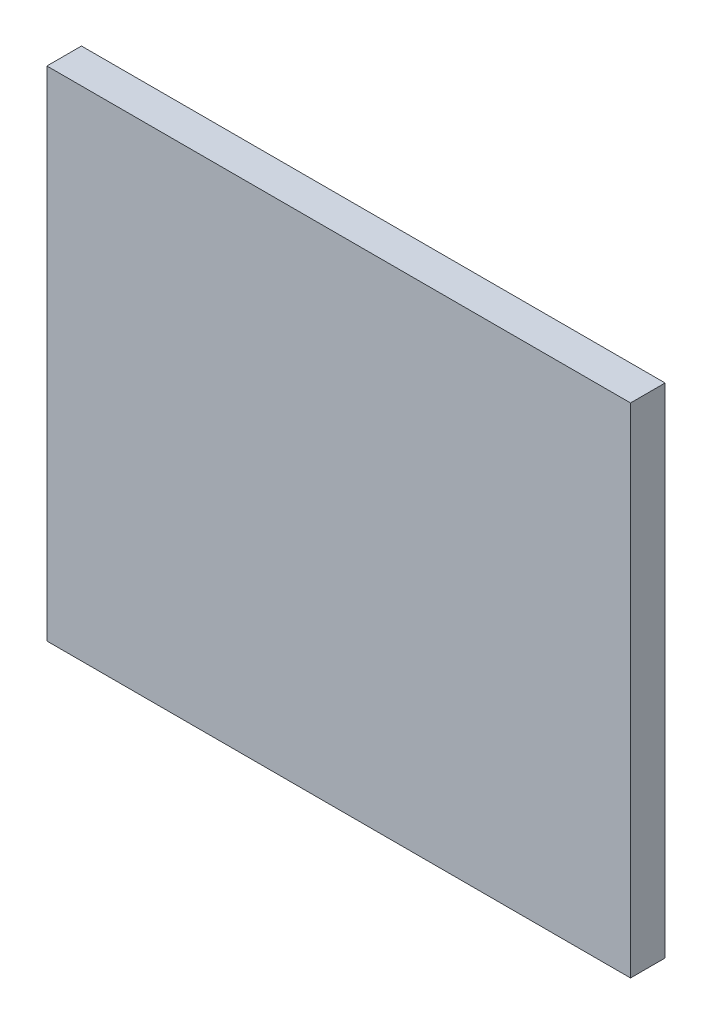
ISO-10303-21;
HEADER;
FILE_DESCRIPTION(('STEP AP214'),'2;1');
FILE_NAME('part.step','',(''),(''),'','','');
FILE_SCHEMA(('AUTOMOTIVE_DESIGN { 1 0 10303 214 1 1 1 1 }'));
ENDSEC;
DATA;
#1=APPLICATION_CONTEXT('core data for automotive mechanical design processes');
#2=APPLICATION_PROTOCOL_DEFINITION('international standard','automotive_design',2000,#1);
#3=PRODUCT_CONTEXT('',#1,'mechanical');
#4=PRODUCT('Part','Part','',(#3));
#5=PRODUCT_RELATED_PRODUCT_CATEGORY('part','',(#4));
#6=PRODUCT_DEFINITION_FORMATION('','',#4);
#7=PRODUCT_DEFINITION_CONTEXT('part definition',#1,'design');
#8=PRODUCT_DEFINITION('design','',#6,#7);
#9=PRODUCT_DEFINITION_SHAPE('','',#8);
#10=(LENGTH_UNIT() NAMED_UNIT(*) SI_UNIT(.MILLI.,.METRE.));
#11=(NAMED_UNIT(*) PLANE_ANGLE_UNIT() SI_UNIT($,.RADIAN.));
#12=(NAMED_UNIT(*) SI_UNIT($,.STERADIAN.) SOLID_ANGLE_UNIT());
#13=UNCERTAINTY_MEASURE_WITH_UNIT(LENGTH_MEASURE(1.E-05),#10,'distance_accuracy_value','');
#14=(GEOMETRIC_REPRESENTATION_CONTEXT(3) GLOBAL_UNCERTAINTY_ASSIGNED_CONTEXT((#13)) GLOBAL_UNIT_ASSIGNED_CONTEXT((#10,
#11,#12)) REPRESENTATION_CONTEXT('',''));
#15=CARTESIAN_POINT('',(0.,0.,0.));
#16=DIRECTION('',(0.,0.,1.));
#17=DIRECTION('',(1.,0.,0.));
#18=AXIS2_PLACEMENT_3D('',#15,#16,#17);
#19=CARTESIAN_POINT('',(0.,-20.,58.));
#20=DIRECTION('',(0.,-1.,0.));
#21=DIRECTION('',(1.,0.,0.));
#22=AXIS2_PLACEMENT_3D('',#19,#20,#21);
#23=PLANE('',#22);
#24=DIRECTION('',(-1.,0.,0.));
#25=VECTOR('',#24,1.);
#26=CARTESIAN_POINT('',(0.,-20.,50.));
#27=LINE('',#26,#25);
#28=CARTESIAN_POINT('',(67.5,-20.,50.));
#29=VERTEX_POINT('',#28);
#30=CARTESIAN_POINT('',(-67.5,-20.0000000000001,50.));
#31=VERTEX_POINT('',#30);
#32=EDGE_CURVE('E103',#29,#31,#27,.T.);
#33=ORIENTED_EDGE('',*,*,#32,.F.);
#34=DIRECTION('',(0.,0.,-1.));
#35=VECTOR('',#34,1.);
#36=CARTESIAN_POINT('',(67.5,-20.,58.));
#37=LINE('',#36,#35);
#38=CARTESIAN_POINT('',(67.5,-20.,58.));
#39=VERTEX_POINT('',#38);
#40=EDGE_CURVE('E11',#39,#29,#37,.T.);
#41=ORIENTED_EDGE('',*,*,#40,.F.);
#42=DIRECTION('',(-1.,0.,0.));
#43=VECTOR('',#42,1.);
#44=CARTESIAN_POINT('',(0.,-20.,58.));
#45=LINE('',#44,#43);
#46=CARTESIAN_POINT('',(-67.5,-20.0000000000001,58.));
#47=VERTEX_POINT('',#46);
#48=EDGE_CURVE('E97',#39,#47,#45,.T.);
#49=ORIENTED_EDGE('',*,*,#48,.T.);
#50=DIRECTION('',(0.,0.,-1.));
#51=VECTOR('',#50,1.);
#52=CARTESIAN_POINT('',(-67.5,-20.0000000000001,58.));
#53=LINE('',#52,#51);
#54=EDGE_CURVE('E42',#47,#31,#53,.T.);
#55=ORIENTED_EDGE('',*,*,#54,.T.);
#56=EDGE_LOOP('',(#33,#41,#49,#55));
#57=FACE_BOUND('',#56,.T.);
#58=ADVANCED_FACE('F39',(#57),#23,.T.);
#59=CARTESIAN_POINT('',(67.5,0.,58.));
#60=DIRECTION('',(1.,0.,0.));
#61=DIRECTION('',(0.,1.,0.));
#62=AXIS2_PLACEMENT_3D('',#59,#60,#61);
#63=PLANE('',#62);
#64=DIRECTION('',(0.,-1.,0.));
#65=VECTOR('',#64,1.);
#66=CARTESIAN_POINT('',(67.5,0.,50.));
#67=LINE('',#66,#65);
#68=CARTESIAN_POINT('',(67.5,95.1987948208455,50.));
#69=VERTEX_POINT('',#68);
#70=EDGE_CURVE('E99',#69,#29,#67,.T.);
#71=ORIENTED_EDGE('',*,*,#70,.F.);
#72=DIRECTION('',(0.,0.,-1.));
#73=VECTOR('',#72,1.);
#74=CARTESIAN_POINT('',(67.5,95.1987948208455,58.));
#75=LINE('',#74,#73);
#76=CARTESIAN_POINT('',(67.5,95.1987948208455,58.));
#77=VERTEX_POINT('',#76);
#78=EDGE_CURVE('E48',#77,#69,#75,.T.);
#79=ORIENTED_EDGE('',*,*,#78,.F.);
#80=DIRECTION('',(0.,-1.,0.));
#81=VECTOR('',#80,1.);
#82=CARTESIAN_POINT('',(67.5,0.,58.));
#83=LINE('',#82,#81);
#84=EDGE_CURVE('E94',#77,#39,#83,.T.);
#85=ORIENTED_EDGE('',*,*,#84,.T.);
#86=ORIENTED_EDGE('',*,*,#40,.T.);
#87=EDGE_LOOP('',(#71,#79,#85,#86));
#88=FACE_BOUND('',#87,.T.);
#89=ADVANCED_FACE('F113',(#88),#63,.T.);
#90=CARTESIAN_POINT('',(0.,95.1987948208455,58.));
#91=DIRECTION('',(0.,1.,0.));
#92=DIRECTION('',(-1.,0.,0.));
#93=AXIS2_PLACEMENT_3D('',#90,#91,#92);
#94=PLANE('',#93);
#95=DIRECTION('',(1.,0.,0.));
#96=VECTOR('',#95,1.);
#97=CARTESIAN_POINT('',(0.,95.1987948208455,50.));
#98=LINE('',#97,#96);
#99=CARTESIAN_POINT('',(-67.5000000000001,95.1987948208454,50.));
#100=VERTEX_POINT('',#99);
#101=EDGE_CURVE('E89',#100,#69,#98,.T.);
#102=ORIENTED_EDGE('',*,*,#101,.F.);
#103=DIRECTION('',(0.,0.,-1.));
#104=VECTOR('',#103,1.);
#105=CARTESIAN_POINT('',(-67.5000000000001,95.1987948208454,58.));
#106=LINE('',#105,#104);
#107=CARTESIAN_POINT('',(-67.5000000000001,95.1987948208454,58.));
#108=VERTEX_POINT('',#107);
#109=EDGE_CURVE('E84',#108,#100,#106,.T.);
#110=ORIENTED_EDGE('',*,*,#109,.F.);
#111=DIRECTION('',(1.,0.,0.));
#112=VECTOR('',#111,1.);
#113=CARTESIAN_POINT('',(0.,95.1987948208455,58.));
#114=LINE('',#113,#112);
#115=EDGE_CURVE('E87',#108,#77,#114,.T.);
#116=ORIENTED_EDGE('',*,*,#115,.T.);
#117=ORIENTED_EDGE('',*,*,#78,.T.);
#118=EDGE_LOOP('',(#102,#110,#116,#117));
#119=FACE_BOUND('',#118,.T.);
#120=ADVANCED_FACE('F86',(#119),#94,.T.);
#121=CARTESIAN_POINT('',(-67.5,0.,58.));
#122=DIRECTION('',(-1.,0.,0.));
#123=DIRECTION('',(0.,-1.,0.));
#124=AXIS2_PLACEMENT_3D('',#121,#122,#123);
#125=PLANE('',#124);
#126=DIRECTION('',(0.,1.,0.));
#127=VECTOR('',#126,1.);
#128=CARTESIAN_POINT('',(-67.5,0.,50.));
#129=LINE('',#128,#127);
#130=EDGE_CURVE('E106',#31,#100,#129,.T.);
#131=ORIENTED_EDGE('',*,*,#130,.F.);
#132=ORIENTED_EDGE('',*,*,#54,.F.);
#133=DIRECTION('',(0.,1.,0.));
#134=VECTOR('',#133,1.);
#135=CARTESIAN_POINT('',(-67.5,0.,58.));
#136=LINE('',#135,#134);
#137=EDGE_CURVE('E93',#47,#108,#136,.T.);
#138=ORIENTED_EDGE('',*,*,#137,.T.);
#139=ORIENTED_EDGE('',*,*,#109,.T.);
#140=EDGE_LOOP('',(#131,#132,#138,#139));
#141=FACE_BOUND('',#140,.T.);
#142=ADVANCED_FACE('F96',(#141),#125,.T.);
#143=CARTESIAN_POINT('',(0.,0.,58.));
#144=DIRECTION('',(0.,0.,-1.));
#145=DIRECTION('',(-1.,0.,0.));
#146=AXIS2_PLACEMENT_3D('',#143,#144,#145);
#147=PLANE('',#146);
#148=ORIENTED_EDGE('',*,*,#48,.F.);
#149=ORIENTED_EDGE('',*,*,#84,.F.);
#150=ORIENTED_EDGE('',*,*,#115,.F.);
#151=ORIENTED_EDGE('',*,*,#137,.F.);
#152=EDGE_LOOP('',(#148,#149,#150,#151));
#153=FACE_BOUND('',#152,.T.);
#154=ADVANCED_FACE('F92',(#153),#147,.F.);
#155=CARTESIAN_POINT('',(0.,0.,50.));
#156=DIRECTION('',(0.,0.,-1.));
#157=DIRECTION('',(-1.,0.,0.));
#158=AXIS2_PLACEMENT_3D('',#155,#156,#157);
#159=PLANE('',#158);
#160=ORIENTED_EDGE('',*,*,#32,.T.);
#161=ORIENTED_EDGE('',*,*,#130,.T.);
#162=ORIENTED_EDGE('',*,*,#101,.T.);
#163=ORIENTED_EDGE('',*,*,#70,.T.);
#164=EDGE_LOOP('',(#160,#161,#162,#163));
#165=FACE_BOUND('',#164,.T.);
#166=ADVANCED_FACE('F112',(#165),#159,.T.);
#167=CLOSED_SHELL('',(#58,#89,#120,#142,#154,#166));
#168=MANIFOLD_SOLID_BREP('B2',#167);
#169=ADVANCED_BREP_SHAPE_REPRESENTATION('',(#18,#168),#14);
#170=SHAPE_DEFINITION_REPRESENTATION(#9,#169);
ENDSEC;
END-ISO-10303-21;
